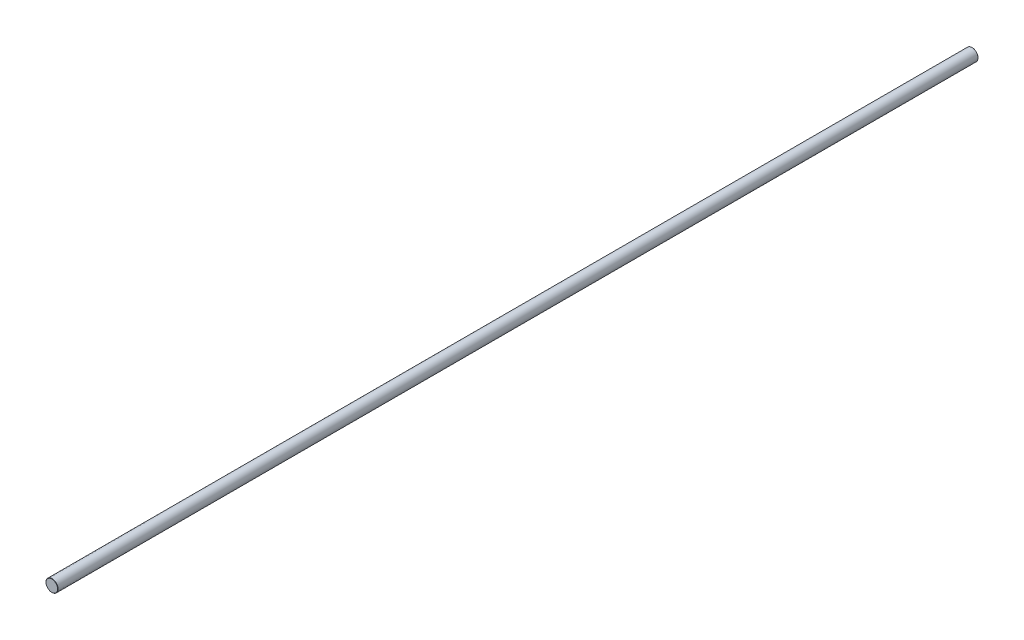
ISO-10303-21;
HEADER;
FILE_DESCRIPTION(('STEP AP214'),'2;1');
FILE_NAME('part.step','',(''),(''),'','','');
FILE_SCHEMA(('AUTOMOTIVE_DESIGN { 1 0 10303 214 1 1 1 1 }'));
ENDSEC;
DATA;
#1=APPLICATION_CONTEXT('core data for automotive mechanical design processes');
#2=APPLICATION_PROTOCOL_DEFINITION('international standard','automotive_design',2000,#1);
#3=PRODUCT_CONTEXT('',#1,'mechanical');
#4=PRODUCT('Part','Part','',(#3));
#5=PRODUCT_RELATED_PRODUCT_CATEGORY('part','',(#4));
#6=PRODUCT_DEFINITION_FORMATION('','',#4);
#7=PRODUCT_DEFINITION_CONTEXT('part definition',#1,'design');
#8=PRODUCT_DEFINITION('design','',#6,#7);
#9=PRODUCT_DEFINITION_SHAPE('','',#8);
#10=(LENGTH_UNIT() NAMED_UNIT(*) SI_UNIT(.MILLI.,.METRE.));
#11=(NAMED_UNIT(*) PLANE_ANGLE_UNIT() SI_UNIT($,.RADIAN.));
#12=(NAMED_UNIT(*) SI_UNIT($,.STERADIAN.) SOLID_ANGLE_UNIT());
#13=UNCERTAINTY_MEASURE_WITH_UNIT(LENGTH_MEASURE(1.E-05),#10,'distance_accuracy_value','');
#14=(GEOMETRIC_REPRESENTATION_CONTEXT(3) GLOBAL_UNCERTAINTY_ASSIGNED_CONTEXT((#13)) GLOBAL_UNIT_ASSIGNED_CONTEXT((#10,
#11,#12)) REPRESENTATION_CONTEXT('',''));
#15=CARTESIAN_POINT('',(0.,0.,0.));
#16=DIRECTION('',(0.,0.,1.));
#17=DIRECTION('',(1.,0.,0.));
#18=AXIS2_PLACEMENT_3D('',#15,#16,#17);
#19=CARTESIAN_POINT('',(0.,0.,457.5));
#20=DIRECTION('',(0.,0.,-1.));
#21=DIRECTION('',(-1.,0.,0.));
#22=AXIS2_PLACEMENT_3D('',#19,#20,#21);
#23=CYLINDRICAL_SURFACE('',#22,6.);
#24=CARTESIAN_POINT('',(0.,0.,-457.259999999999));
#25=DIRECTION('',(0.,0.,1.));
#26=DIRECTION('',(1.,0.,0.));
#27=AXIS2_PLACEMENT_3D('',#24,#25,#26);
#28=CIRCLE('',#27,6.);
#29=CARTESIAN_POINT('',(6.,0.,-457.259999999999));
#30=VERTEX_POINT('',#29);
#31=EDGE_CURVE('E56',#30,#30,#28,.T.);
#32=ORIENTED_EDGE('',*,*,#31,.T.);
#33=EDGE_LOOP('',(#32));
#34=FACE_BOUND('',#33,.T.);
#35=CARTESIAN_POINT('',(0.,0.,457.26));
#36=DIRECTION('',(0.,0.,1.));
#37=DIRECTION('',(1.,0.,0.));
#38=AXIS2_PLACEMENT_3D('',#35,#36,#37);
#39=CIRCLE('',#38,6.);
#40=CARTESIAN_POINT('',(6.,0.,457.26));
#41=VERTEX_POINT('',#40);
#42=EDGE_CURVE('E61',#41,#41,#39,.F.);
#43=ORIENTED_EDGE('',*,*,#42,.T.);
#44=EDGE_LOOP('',(#43));
#45=FACE_BOUND('',#44,.T.);
#46=ADVANCED_FACE('F43',(#34,#45),#23,.T.);
#47=CARTESIAN_POINT('',(0.,0.,457.5));
#48=DIRECTION('',(0.,0.,1.));
#49=DIRECTION('',(1.,0.,0.));
#50=AXIS2_PLACEMENT_3D('',#47,#48,#49);
#51=PLANE('',#50);
#52=CARTESIAN_POINT('',(0.,0.,457.5));
#53=DIRECTION('',(0.,0.,1.));
#54=DIRECTION('',(1.,0.,0.));
#55=AXIS2_PLACEMENT_3D('',#52,#53,#54);
#56=CIRCLE('',#55,5.76000000000043);
#57=CARTESIAN_POINT('',(5.76000000000043,0.,457.5));
#58=VERTEX_POINT('',#57);
#59=EDGE_CURVE('E10',#58,#58,#56,.T.);
#60=ORIENTED_EDGE('',*,*,#59,.T.);
#61=EDGE_LOOP('',(#60));
#62=FACE_BOUND('',#61,.T.);
#63=ADVANCED_FACE('F78',(#62),#51,.T.);
#64=CARTESIAN_POINT('',(0.,0.,-457.5));
#65=DIRECTION('',(0.,0.,1.));
#66=DIRECTION('',(1.,0.,0.));
#67=AXIS2_PLACEMENT_3D('',#64,#65,#66);
#68=PLANE('',#67);
#69=CARTESIAN_POINT('',(0.,0.,-457.5));
#70=DIRECTION('',(0.,0.,1.));
#71=DIRECTION('',(1.,0.,0.));
#72=AXIS2_PLACEMENT_3D('',#69,#70,#71);
#73=CIRCLE('',#72,5.75999999999921);
#74=CARTESIAN_POINT('',(5.75999999999921,0.,-457.5));
#75=VERTEX_POINT('',#74);
#76=EDGE_CURVE('E51',#75,#75,#73,.F.);
#77=ORIENTED_EDGE('',*,*,#76,.T.);
#78=EDGE_LOOP('',(#77));
#79=FACE_BOUND('',#78,.T.);
#80=ADVANCED_FACE('F75',(#79),#68,.F.);
#81=CARTESIAN_POINT('',(0.,0.,-457.259999999999));
#82=DIRECTION('',(0.,0.,1.));
#83=DIRECTION('',(1.,0.,0.));
#84=AXIS2_PLACEMENT_3D('',#81,#82,#83);
#85=CONICAL_SURFACE('',#84,6.,0.785398163397441);
#86=ORIENTED_EDGE('',*,*,#76,.F.);
#87=EDGE_LOOP('',(#86));
#88=FACE_BOUND('',#87,.T.);
#89=ORIENTED_EDGE('',*,*,#31,.F.);
#90=EDGE_LOOP('',(#89));
#91=FACE_BOUND('',#90,.T.);
#92=ADVANCED_FACE('F71',(#88,#91),#85,.T.);
#93=CARTESIAN_POINT('',(0.,0.,457.5));
#94=DIRECTION('',(0.,0.,-1.));
#95=DIRECTION('',(-1.,0.,0.));
#96=AXIS2_PLACEMENT_3D('',#93,#94,#95);
#97=CONICAL_SURFACE('',#96,5.76000000000043,0.785398163397443);
#98=ORIENTED_EDGE('',*,*,#42,.F.);
#99=EDGE_LOOP('',(#98));
#100=FACE_BOUND('',#99,.T.);
#101=ORIENTED_EDGE('',*,*,#59,.F.);
#102=EDGE_LOOP('',(#101));
#103=FACE_BOUND('',#102,.T.);
#104=ADVANCED_FACE('F45',(#100,#103),#97,.T.);
#105=CLOSED_SHELL('',(#46,#63,#80,#92,#104));
#106=MANIFOLD_SOLID_BREP('B2',#105);
#107=ADVANCED_BREP_SHAPE_REPRESENTATION('',(#18,#106),#14);
#108=SHAPE_DEFINITION_REPRESENTATION(#9,#107);
ENDSEC;
END-ISO-10303-21;
